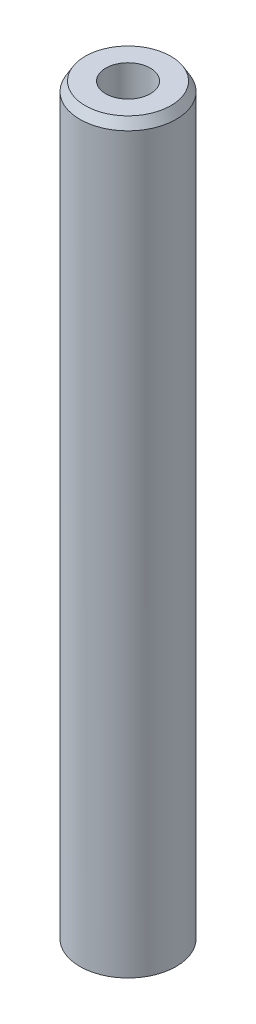
ISO-10303-21;
HEADER;
FILE_DESCRIPTION(('STEP AP214'),'2;1');
FILE_NAME('part.step','',(''),(''),'','','');
FILE_SCHEMA(('AUTOMOTIVE_DESIGN { 1 0 10303 214 1 1 1 1 }'));
ENDSEC;
DATA;
#1=APPLICATION_CONTEXT('core data for automotive mechanical design processes');
#2=APPLICATION_PROTOCOL_DEFINITION('international standard','automotive_design',2000,#1);
#3=PRODUCT_CONTEXT('',#1,'mechanical');
#4=PRODUCT('Part','Part','',(#3));
#5=PRODUCT_RELATED_PRODUCT_CATEGORY('part','',(#4));
#6=PRODUCT_DEFINITION_FORMATION('','',#4);
#7=PRODUCT_DEFINITION_CONTEXT('part definition',#1,'design');
#8=PRODUCT_DEFINITION('design','',#6,#7);
#9=PRODUCT_DEFINITION_SHAPE('','',#8);
#10=(LENGTH_UNIT() NAMED_UNIT(*) SI_UNIT(.MILLI.,.METRE.));
#11=(NAMED_UNIT(*) PLANE_ANGLE_UNIT() SI_UNIT($,.RADIAN.));
#12=(NAMED_UNIT(*) SI_UNIT($,.STERADIAN.) SOLID_ANGLE_UNIT());
#13=UNCERTAINTY_MEASURE_WITH_UNIT(LENGTH_MEASURE(1.E-05),#10,'distance_accuracy_value','');
#14=(GEOMETRIC_REPRESENTATION_CONTEXT(3) GLOBAL_UNCERTAINTY_ASSIGNED_CONTEXT((#13)) GLOBAL_UNIT_ASSIGNED_CONTEXT((#10,
#11,#12)) REPRESENTATION_CONTEXT('',''));
#15=CARTESIAN_POINT('',(0.,0.,0.));
#16=DIRECTION('',(0.,0.,1.));
#17=DIRECTION('',(1.,0.,0.));
#18=AXIS2_PLACEMENT_3D('',#15,#16,#17);
#19=CARTESIAN_POINT('',(0.,233.122431272597,0.));
#20=DIRECTION('',(0.,-1.,0.));
#21=DIRECTION('',(0.,0.,-1.));
#22=AXIS2_PLACEMENT_3D('',#19,#20,#21);
#23=CYLINDRICAL_SURFACE('',#22,15.);
#24=CARTESIAN_POINT('',(0.,230.251574552988,0.));
#25=DIRECTION('',(0.,1.,0.));
#26=DIRECTION('',(0.,0.,1.));
#27=AXIS2_PLACEMENT_3D('',#24,#25,#26);
#28=CIRCLE('',#27,15.);
#29=CARTESIAN_POINT('',(0.,230.251574552988,-15.));
#30=VERTEX_POINT('',#29);
#31=EDGE_CURVE('E50',#30,#30,#28,.F.);
#32=ORIENTED_EDGE('',*,*,#31,.T.);
#33=EDGE_LOOP('',(#32));
#34=FACE_BOUND('',#33,.T.);
#35=CARTESIAN_POINT('',(0.,1.65748989987155,0.));
#36=DIRECTION('',(0.,1.,0.));
#37=DIRECTION('',(0.,0.,1.));
#38=AXIS2_PLACEMENT_3D('',#35,#36,#37);
#39=CIRCLE('',#38,15.);
#40=CARTESIAN_POINT('',(0.,1.65748989987155,15.));
#41=VERTEX_POINT('',#40);
#42=EDGE_CURVE('E51',#41,#41,#39,.T.);
#43=ORIENTED_EDGE('',*,*,#42,.T.);
#44=EDGE_LOOP('',(#43));
#45=FACE_BOUND('',#44,.T.);
#46=ADVANCED_FACE('F39',(#34,#45),#23,.T.);
#47=CARTESIAN_POINT('',(0.,233.122431272597,0.));
#48=DIRECTION('',(0.,1.,0.));
#49=DIRECTION('',(0.,0.,1.));
#50=AXIS2_PLACEMENT_3D('',#47,#48,#49);
#51=PLANE('',#50);
#52=CARTESIAN_POINT('',(0.,233.122431272597,0.));
#53=DIRECTION('',(0.,1.,0.));
#54=DIRECTION('',(0.,0.,1.));
#55=AXIS2_PLACEMENT_3D('',#52,#53,#54);
#56=CIRCLE('',#55,13.3425101001285);
#57=CARTESIAN_POINT('',(0.,233.122431272597,-13.3425101001285));
#58=VERTEX_POINT('',#57);
#59=EDGE_CURVE('E54',#58,#58,#56,.T.);
#60=ORIENTED_EDGE('',*,*,#59,.T.);
#61=EDGE_LOOP('',(#60));
#62=FACE_BOUND('',#61,.T.);
#63=CARTESIAN_POINT('',(0.,233.122431272597,0.));
#64=DIRECTION('',(0.,1.,0.));
#65=DIRECTION('',(0.,0.,1.));
#66=AXIS2_PLACEMENT_3D('',#63,#64,#65);
#67=CIRCLE('',#66,6.94667668107319);
#68=CARTESIAN_POINT('',(0.,233.122431272597,6.94667668107319));
#69=VERTEX_POINT('',#68);
#70=EDGE_CURVE('E58',#69,#69,#67,.T.);
#71=ORIENTED_EDGE('',*,*,#70,.F.);
#72=EDGE_LOOP('',(#71));
#73=FACE_BOUND('',#72,.T.);
#74=ADVANCED_FACE('F69',(#62,#73),#51,.T.);
#75=CARTESIAN_POINT('',(0.,0.,0.));
#76=DIRECTION('',(0.,1.,0.));
#77=DIRECTION('',(0.,0.,1.));
#78=AXIS2_PLACEMENT_3D('',#75,#76,#77);
#79=PLANE('',#78);
#80=CARTESIAN_POINT('',(0.,0.,0.));
#81=DIRECTION('',(0.,1.,0.));
#82=DIRECTION('',(0.,0.,1.));
#83=AXIS2_PLACEMENT_3D('',#80,#81,#82);
#84=CIRCLE('',#83,12.1291432803902);
#85=CARTESIAN_POINT('',(0.,0.,12.1291432803902));
#86=VERTEX_POINT('',#85);
#87=EDGE_CURVE('E10',#86,#86,#84,.F.);
#88=ORIENTED_EDGE('',*,*,#87,.T.);
#89=EDGE_LOOP('',(#88));
#90=FACE_BOUND('',#89,.T.);
#91=CARTESIAN_POINT('',(0.,0.,0.));
#92=DIRECTION('',(0.,1.,0.));
#93=DIRECTION('',(0.,0.,1.));
#94=AXIS2_PLACEMENT_3D('',#91,#92,#93);
#95=CIRCLE('',#94,6.94667668107319);
#96=CARTESIAN_POINT('',(0.,0.,6.94667668107319));
#97=VERTEX_POINT('',#96);
#98=EDGE_CURVE('E63',#97,#97,#95,.T.);
#99=ORIENTED_EDGE('',*,*,#98,.T.);
#100=EDGE_LOOP('',(#99));
#101=FACE_BOUND('',#100,.T.);
#102=ADVANCED_FACE('F75',(#90,#101),#79,.F.);
#103=CARTESIAN_POINT('',(0.,233.122431272597,0.));
#104=DIRECTION('',(0.,-1.,0.));
#105=DIRECTION('',(0.,0.,-1.));
#106=AXIS2_PLACEMENT_3D('',#103,#104,#105);
#107=CYLINDRICAL_SURFACE('',#106,6.94667668107319);
#108=ORIENTED_EDGE('',*,*,#70,.T.);
#109=EDGE_LOOP('',(#108));
#110=FACE_BOUND('',#109,.T.);
#111=ORIENTED_EDGE('',*,*,#98,.F.);
#112=EDGE_LOOP('',(#111));
#113=FACE_BOUND('',#112,.T.);
#114=ADVANCED_FACE('F70',(#110,#113),#107,.F.);
#115=CARTESIAN_POINT('',(0.,233.122431272597,0.));
#116=DIRECTION('',(0.,-1.,0.));
#117=DIRECTION('',(0.,0.,-1.));
#118=AXIS2_PLACEMENT_3D('',#115,#116,#117);
#119=CONICAL_SURFACE('',#118,13.3425101001285,0.523598775598294);
#120=CARTESIAN_POINT('',(0.,230.251574552988,-15.));
#121=CARTESIAN_POINT('',(0.,230.281479310484,-14.9827344802097));
#122=CARTESIAN_POINT('',(0.,230.31138406798,-14.9654689604194));
#123=CARTESIAN_POINT('',(0.,230.371193582971,-14.9309379208387));
#124=CARTESIAN_POINT('',(0.,230.401098340467,-14.9136724010484));
#125=CARTESIAN_POINT('',(0.,230.460907855459,-14.8791413614677));
#126=CARTESIAN_POINT('',(0.,230.490812612955,-14.8618758416774));
#127=CARTESIAN_POINT('',(0.,230.550622127947,-14.8273448020967));
#128=CARTESIAN_POINT('',(0.,230.580526885443,-14.8100792823064));
#129=CARTESIAN_POINT('',(0.,230.640336400435,-14.7755482427257));
#130=CARTESIAN_POINT('',(0.,230.670241157931,-14.7582827229354));
#131=CARTESIAN_POINT('',(0.,230.730050672923,-14.7237516833548));
#132=CARTESIAN_POINT('',(0.,230.759955430419,-14.7064861635644));
#133=CARTESIAN_POINT('',(0.,230.81976494541,-14.6719551239838));
#134=CARTESIAN_POINT('',(0.,230.849669702906,-14.6546896041934));
#135=CARTESIAN_POINT('',(0.,230.909479217898,-14.6201585646128));
#136=CARTESIAN_POINT('',(0.,230.939383975394,-14.6028930448225));
#137=CARTESIAN_POINT('',(0.,230.999193490386,-14.5683620052418));
#138=CARTESIAN_POINT('',(0.,231.029098247882,-14.5510964854515));
#139=CARTESIAN_POINT('',(0.,231.088907762874,-14.5165654458708));
#140=CARTESIAN_POINT('',(0.,231.11881252037,-14.4992999260805));
#141=CARTESIAN_POINT('',(0.,231.178622035362,-14.4647688864998));
#142=CARTESIAN_POINT('',(0.,231.208526792858,-14.4475033667095));
#143=CARTESIAN_POINT('',(0.,231.268336307849,-14.4129723271289));
#144=CARTESIAN_POINT('',(0.,231.298241065345,-14.3957068073385));
#145=CARTESIAN_POINT('',(0.,231.358050580337,-14.3611757677579));
#146=CARTESIAN_POINT('',(0.,231.387955337833,-14.3439102479675));
#147=CARTESIAN_POINT('',(0.,231.447764852825,-14.3093792083869));
#148=CARTESIAN_POINT('',(0.,231.477669610321,-14.2921136885966));
#149=CARTESIAN_POINT('',(0.,231.537479125313,-14.2575826490159));
#150=CARTESIAN_POINT('',(0.,231.567383882809,-14.2403171292256));
#151=CARTESIAN_POINT('',(0.,231.627193397801,-14.2057860896449));
#152=CARTESIAN_POINT('',(0.,231.657098155297,-14.1885205698546));
#153=CARTESIAN_POINT('',(0.,231.716907670288,-14.1539895302739));
#154=CARTESIAN_POINT('',(0.,231.746812427784,-14.1367240104836));
#155=CARTESIAN_POINT('',(0.,231.806621942776,-14.1021929709029));
#156=CARTESIAN_POINT('',(0.,231.836526700272,-14.0849274511126));
#157=CARTESIAN_POINT('',(0.,231.896336215264,-14.050396411532));
#158=CARTESIAN_POINT('',(0.,231.92624097276,-14.0331308917416));
#159=CARTESIAN_POINT('',(0.,231.986050487752,-13.998599852161));
#160=CARTESIAN_POINT('',(0.,232.015955245248,-13.9813343323707));
#161=CARTESIAN_POINT('',(0.,232.07576476024,-13.94680329279));
#162=CARTESIAN_POINT('',(0.,232.105669517736,-13.9295377729997));
#163=CARTESIAN_POINT('',(0.,232.165479032728,-13.895006733419));
#164=CARTESIAN_POINT('',(0.,232.195383790223,-13.8777412136287));
#165=CARTESIAN_POINT('',(0.,232.255193305215,-13.843210174048));
#166=CARTESIAN_POINT('',(0.,232.285098062711,-13.8259446542577));
#167=CARTESIAN_POINT('',(0.,232.344907577703,-13.791413614677));
#168=CARTESIAN_POINT('',(0.,232.374812335199,-13.7741480948867));
#169=CARTESIAN_POINT('',(0.,232.434621850191,-13.7396170553061));
#170=CARTESIAN_POINT('',(0.,232.464526607687,-13.7223515355157));
#171=CARTESIAN_POINT('',(0.,232.524336122679,-13.6878204959351));
#172=CARTESIAN_POINT('',(0.,232.554240880175,-13.6705549761447));
#173=CARTESIAN_POINT('',(0.,232.614050395167,-13.6360239365641));
#174=CARTESIAN_POINT('',(0.,232.643955152662,-13.6187584167738));
#175=CARTESIAN_POINT('',(0.,232.703764667654,-13.5842273771931));
#176=CARTESIAN_POINT('',(0.,232.73366942515,-13.5669618574028));
#177=CARTESIAN_POINT('',(0.,232.793478940142,-13.5324308178221));
#178=CARTESIAN_POINT('',(0.,232.823383697638,-13.5151652980318));
#179=CARTESIAN_POINT('',(0.,232.88319321263,-13.4806342584511));
#180=CARTESIAN_POINT('',(0.,232.913097970126,-13.4633687386608));
#181=CARTESIAN_POINT('',(0.,232.972907485118,-13.4288376990802));
#182=CARTESIAN_POINT('',(0.,233.002812242614,-13.4115721792898));
#183=CARTESIAN_POINT('',(0.,233.062621757606,-13.3770411397092));
#184=CARTESIAN_POINT('',(0.,233.092526515101,-13.3597756199188));
#185=CARTESIAN_POINT('',(0.,233.122431272597,-13.3425101001285));
#186=B_SPLINE_CURVE_WITH_KNOTS('',3,(#120,#121,#122,#123,#124,#125,#126,#127,#128,#129,#130,
#131,#132,#133,#134,#135,#136,#137,#138,#139,#140,#141,#142,#143,#144,#145,#146,#147,#148,#149,
#150,#151,#152,#153,#154,#155,#156,#157,#158,#159,#160,#161,#162,#163,#164,#165,#166,#167,#168,
#169,#170,#171,#172,#173,#174,#175,#176,#177,#178,#179,#180,#181,#182,#183,#184,#185),
.UNSPECIFIED.,.F.,.F.,(4,2,2,2,2,2,2,2,2,2,2,2,2,2,2,2,2,2,2,2,2,2,2,2,2,2,2,2,2,2,2,2,4),(0.,
0.103593118741991,0.207186237483958,0.310779356225925,0.414372474967892,0.517965593709859,
0.621558712451826,0.725151831193793,0.82874494993576,0.932338068677728,1.03593118741969,
1.13952430616169,1.24311742490365,1.34671054364562,1.45030366238759,1.55389678112955,
1.65748989987152,1.76108301861349,1.86467613735545,1.96826925609742,2.07186237483939,
2.17545549358136,2.27904861232335,2.38264173106531,2.48623484980728,2.58982796854925,
2.69342108729121,2.79701420603318,2.90060732477515,3.00420044351712,3.10779356225908,
3.21138668100105,3.31497979974304),.UNSPECIFIED.);
#187=EDGE_CURVE('BSEAM81',#30,#58,#186,.T.);
#188=ORIENTED_EDGE('',*,*,#31,.F.);
#189=ORIENTED_EDGE('',*,*,#59,.F.);
#190=ORIENTED_EDGE('',*,*,#187,.T.);
#191=ORIENTED_EDGE('',*,*,#187,.F.);
#192=EDGE_LOOP('',(#188,#190,#189,#191));
#193=FACE_BOUND('',#192,.T.);
#194=ADVANCED_FACE('F81',(#193),#119,.T.);
#195=CARTESIAN_POINT('',(0.,1.65748989987155,0.));
#196=DIRECTION('',(0.,1.,0.));
#197=DIRECTION('',(0.,0.,1.));
#198=AXIS2_PLACEMENT_3D('',#195,#196,#197);
#199=CONICAL_SURFACE('',#198,15.,1.0471975511966);
#200=ORIENTED_EDGE('',*,*,#87,.F.);
#201=EDGE_LOOP('',(#200));
#202=FACE_BOUND('',#201,.T.);
#203=ORIENTED_EDGE('',*,*,#42,.F.);
#204=EDGE_LOOP('',(#203));
#205=FACE_BOUND('',#204,.T.);
#206=ADVANCED_FACE('F45',(#202,#205),#199,.T.);
#207=CLOSED_SHELL('',(#46,#74,#102,#114,#194,#206));
#208=MANIFOLD_SOLID_BREP('B2',#207);
#209=ADVANCED_BREP_SHAPE_REPRESENTATION('',(#18,#208),#14);
#210=SHAPE_DEFINITION_REPRESENTATION(#9,#209);
ENDSEC;
END-ISO-10303-21;
